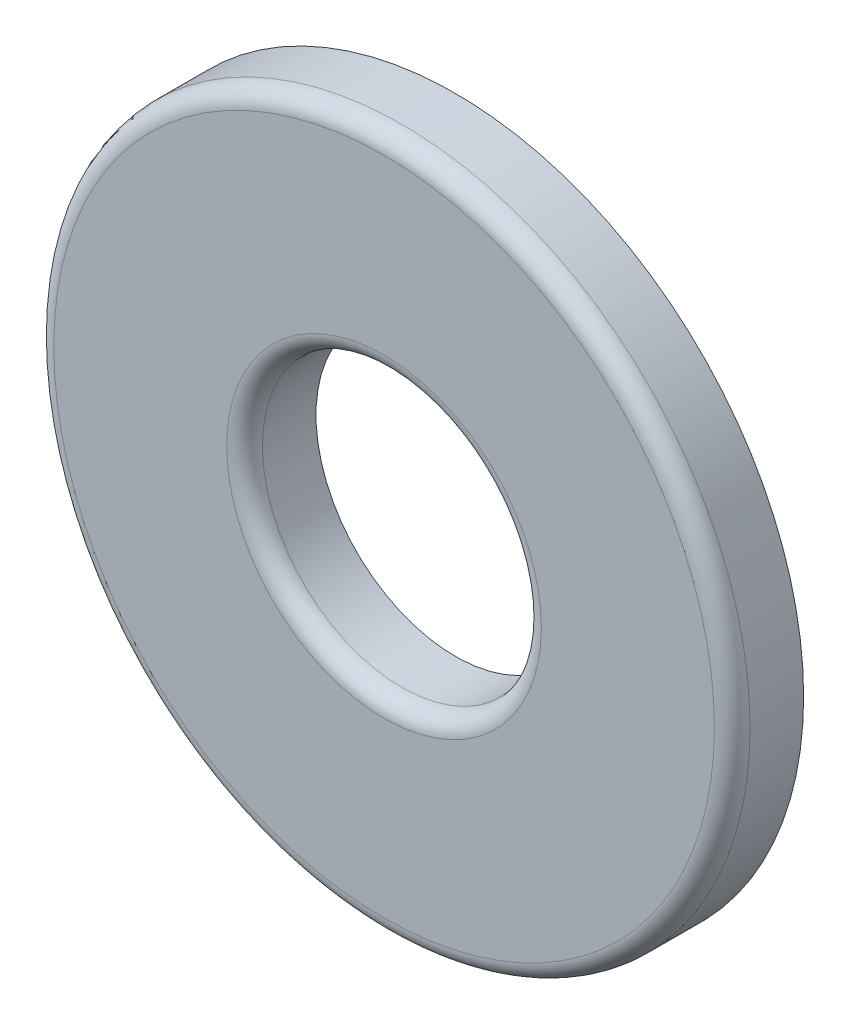
ISO-10303-21;
HEADER;
FILE_DESCRIPTION(('STEP AP214'),'2;1');
FILE_NAME('part.step','',(''),(''),'','','');
FILE_SCHEMA(('AUTOMOTIVE_DESIGN { 1 0 10303 214 1 1 1 1 }'));
ENDSEC;
DATA;
#1=APPLICATION_CONTEXT('core data for automotive mechanical design processes');
#2=APPLICATION_PROTOCOL_DEFINITION('international standard','automotive_design',2000,#1);
#3=PRODUCT_CONTEXT('',#1,'mechanical');
#4=PRODUCT('Part','Part','',(#3));
#5=PRODUCT_RELATED_PRODUCT_CATEGORY('part','',(#4));
#6=PRODUCT_DEFINITION_FORMATION('','',#4);
#7=PRODUCT_DEFINITION_CONTEXT('part definition',#1,'design');
#8=PRODUCT_DEFINITION('design','',#6,#7);
#9=PRODUCT_DEFINITION_SHAPE('','',#8);
#10=(LENGTH_UNIT() NAMED_UNIT(*) SI_UNIT(.MILLI.,.METRE.));
#11=(NAMED_UNIT(*) PLANE_ANGLE_UNIT() SI_UNIT($,.RADIAN.));
#12=(NAMED_UNIT(*) SI_UNIT($,.STERADIAN.) SOLID_ANGLE_UNIT());
#13=UNCERTAINTY_MEASURE_WITH_UNIT(LENGTH_MEASURE(1.E-05),#10,'distance_accuracy_value','');
#14=(GEOMETRIC_REPRESENTATION_CONTEXT(3) GLOBAL_UNCERTAINTY_ASSIGNED_CONTEXT((#13)) GLOBAL_UNIT_ASSIGNED_CONTEXT((#10,
#11,#12)) REPRESENTATION_CONTEXT('',''));
#15=CARTESIAN_POINT('',(0.,0.,0.));
#16=DIRECTION('',(0.,0.,1.));
#17=DIRECTION('',(1.,0.,0.));
#18=AXIS2_PLACEMENT_3D('',#15,#16,#17);
#19=CARTESIAN_POINT('',(0.,0.,0.406399999999997));
#20=DIRECTION('',(0.,0.,1.));
#21=DIRECTION('',(1.,0.,0.));
#22=AXIS2_PLACEMENT_3D('',#19,#20,#21);
#23=PLANE('',#22);
#24=CARTESIAN_POINT('',(0.,0.,0.406399999999997));
#25=DIRECTION('',(0.,0.,1.));
#26=DIRECTION('',(1.,0.,0.));
#27=AXIS2_PLACEMENT_3D('',#24,#25,#26);
#28=CIRCLE('',#27,3.7592);
#29=CARTESIAN_POINT('',(3.7592,0.,0.406399999999997));
#30=VERTEX_POINT('',#29);
#31=EDGE_CURVE('E44',#30,#30,#28,.T.);
#32=ORIENTED_EDGE('',*,*,#31,.T.);
#33=EDGE_LOOP('',(#32));
#34=FACE_BOUND('',#33,.T.);
#35=CARTESIAN_POINT('',(0.,0.,0.406399999999997));
#36=DIRECTION('',(0.,0.,1.));
#37=DIRECTION('',(1.,0.,0.));
#38=AXIS2_PLACEMENT_3D('',#35,#36,#37);
#39=CIRCLE('',#38,1.7907);
#40=CARTESIAN_POINT('',(1.7907,0.,0.406399999999997));
#41=VERTEX_POINT('',#40);
#42=EDGE_CURVE('E48',#41,#41,#39,.F.);
#43=ORIENTED_EDGE('',*,*,#42,.T.);
#44=EDGE_LOOP('',(#43));
#45=FACE_BOUND('',#44,.T.);
#46=ADVANCED_FACE('F33',(#34,#45),#23,.T.);
#47=CARTESIAN_POINT('',(0.,0.,0.406399999999997));
#48=DIRECTION('',(0.,0.,-1.));
#49=DIRECTION('',(-1.,0.,0.));
#50=AXIS2_PLACEMENT_3D('',#47,#48,#49);
#51=CYLINDRICAL_SURFACE('',#50,3.9624);
#52=CARTESIAN_POINT('',(0.,0.,0.203199999999997));
#53=DIRECTION('',(0.,0.,1.));
#54=DIRECTION('',(1.,0.,0.));
#55=AXIS2_PLACEMENT_3D('',#52,#53,#54);
#56=CIRCLE('',#55,3.9624);
#57=CARTESIAN_POINT('',(3.9624,0.,0.203199999999997));
#58=VERTEX_POINT('',#57);
#59=EDGE_CURVE('E40',#58,#58,#56,.F.);
#60=ORIENTED_EDGE('',*,*,#59,.T.);
#61=EDGE_LOOP('',(#60));
#62=FACE_BOUND('',#61,.T.);
#63=CARTESIAN_POINT('',(0.,0.,-0.406400000000003));
#64=DIRECTION('',(0.,0.,1.));
#65=DIRECTION('',(1.,0.,0.));
#66=AXIS2_PLACEMENT_3D('',#63,#64,#65);
#67=CIRCLE('',#66,3.9624);
#68=CARTESIAN_POINT('',(3.9624,0.,-0.406400000000003));
#69=VERTEX_POINT('',#68);
#70=EDGE_CURVE('E53',#69,#69,#67,.T.);
#71=ORIENTED_EDGE('',*,*,#70,.T.);
#72=EDGE_LOOP('',(#71));
#73=FACE_BOUND('',#72,.T.);
#74=ADVANCED_FACE('F65',(#62,#73),#51,.T.);
#75=CARTESIAN_POINT('',(0.,0.,0.406399999999997));
#76=DIRECTION('',(0.,0.,-1.));
#77=DIRECTION('',(-1.,0.,0.));
#78=AXIS2_PLACEMENT_3D('',#75,#76,#77);
#79=CYLINDRICAL_SURFACE('',#78,1.5875);
#80=CARTESIAN_POINT('',(0.,0.,0.203199999999997));
#81=DIRECTION('',(0.,0.,1.));
#82=DIRECTION('',(1.,0.,0.));
#83=AXIS2_PLACEMENT_3D('',#80,#81,#82);
#84=CIRCLE('',#83,1.5875);
#85=CARTESIAN_POINT('',(1.5875,0.,0.203199999999997));
#86=VERTEX_POINT('',#85);
#87=EDGE_CURVE('E10',#86,#86,#84,.T.);
#88=ORIENTED_EDGE('',*,*,#87,.T.);
#89=EDGE_LOOP('',(#88));
#90=FACE_BOUND('',#89,.T.);
#91=CARTESIAN_POINT('',(0.,0.,-0.406400000000003));
#92=DIRECTION('',(0.,0.,1.));
#93=DIRECTION('',(1.,0.,0.));
#94=AXIS2_PLACEMENT_3D('',#91,#92,#93);
#95=CIRCLE('',#94,1.5875);
#96=CARTESIAN_POINT('',(1.5875,0.,-0.406400000000003));
#97=VERTEX_POINT('',#96);
#98=EDGE_CURVE('E56',#97,#97,#95,.T.);
#99=ORIENTED_EDGE('',*,*,#98,.F.);
#100=EDGE_LOOP('',(#99));
#101=FACE_BOUND('',#100,.T.);
#102=ADVANCED_FACE('F63',(#90,#101),#79,.F.);
#103=CARTESIAN_POINT('',(0.,0.,-0.406400000000003));
#104=DIRECTION('',(0.,0.,1.));
#105=DIRECTION('',(1.,0.,0.));
#106=AXIS2_PLACEMENT_3D('',#103,#104,#105);
#107=PLANE('',#106);
#108=ORIENTED_EDGE('',*,*,#98,.T.);
#109=EDGE_LOOP('',(#108));
#110=FACE_BOUND('',#109,.T.);
#111=ORIENTED_EDGE('',*,*,#70,.F.);
#112=EDGE_LOOP('',(#111));
#113=FACE_BOUND('',#112,.T.);
#114=ADVANCED_FACE('F60',(#110,#113),#107,.F.);
#115=CARTESIAN_POINT('',(0.,0.,0.203199999999997));
#116=DIRECTION('',(0.,0.,1.));
#117=DIRECTION('',(1.,0.,0.));
#118=AXIS2_PLACEMENT_3D('',#115,#116,#117);
#119=TOROIDAL_SURFACE('',#118,3.7592,0.2032);
#120=ORIENTED_EDGE('',*,*,#59,.F.);
#121=EDGE_LOOP('',(#120));
#122=FACE_BOUND('',#121,.T.);
#123=ORIENTED_EDGE('',*,*,#31,.F.);
#124=EDGE_LOOP('',(#123));
#125=FACE_BOUND('',#124,.T.);
#126=ADVANCED_FACE('F71',(#122,#125),#119,.T.);
#127=CARTESIAN_POINT('',(0.,0.,0.203199999999997));
#128=DIRECTION('',(0.,0.,1.));
#129=DIRECTION('',(1.,0.,0.));
#130=AXIS2_PLACEMENT_3D('',#127,#128,#129);
#131=TOROIDAL_SURFACE('',#130,1.7907,0.2032);
#132=ORIENTED_EDGE('',*,*,#42,.F.);
#133=EDGE_LOOP('',(#132));
#134=FACE_BOUND('',#133,.T.);
#135=ORIENTED_EDGE('',*,*,#87,.F.);
#136=EDGE_LOOP('',(#135));
#137=FACE_BOUND('',#136,.T.);
#138=ADVANCED_FACE('F35',(#134,#137),#131,.T.);
#139=CLOSED_SHELL('',(#46,#74,#102,#114,#126,#138));
#140=MANIFOLD_SOLID_BREP('B2',#139);
#141=ADVANCED_BREP_SHAPE_REPRESENTATION('',(#18,#140),#14);
#142=SHAPE_DEFINITION_REPRESENTATION(#9,#141);
ENDSEC;
END-ISO-10303-21;
